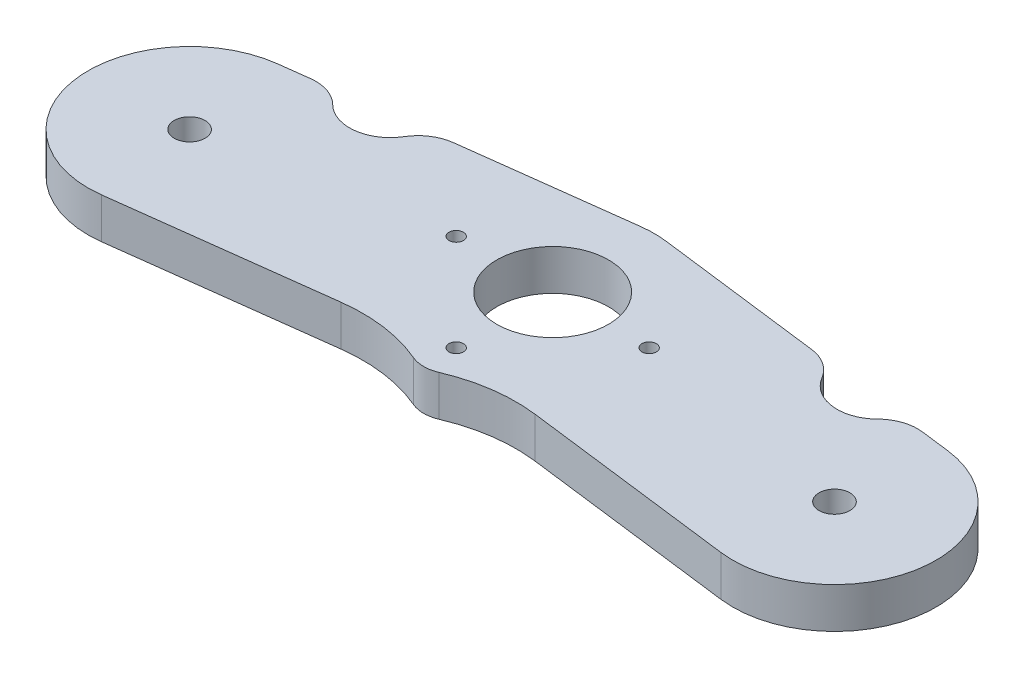
ISO-10303-21;
HEADER;
FILE_DESCRIPTION(('STEP AP214'),'2;1');
FILE_NAME('part.step','',(''),(''),'','','');
FILE_SCHEMA(('AUTOMOTIVE_DESIGN { 1 0 10303 214 1 1 1 1 }'));
ENDSEC;
DATA;
#1=APPLICATION_CONTEXT('core data for automotive mechanical design processes');
#2=APPLICATION_PROTOCOL_DEFINITION('international standard','automotive_design',2000,#1);
#3=PRODUCT_CONTEXT('',#1,'mechanical');
#4=PRODUCT('Part','Part','',(#3));
#5=PRODUCT_RELATED_PRODUCT_CATEGORY('part','',(#4));
#6=PRODUCT_DEFINITION_FORMATION('','',#4);
#7=PRODUCT_DEFINITION_CONTEXT('part definition',#1,'design');
#8=PRODUCT_DEFINITION('design','',#6,#7);
#9=PRODUCT_DEFINITION_SHAPE('','',#8);
#10=(LENGTH_UNIT() NAMED_UNIT(*) SI_UNIT(.MILLI.,.METRE.));
#11=(NAMED_UNIT(*) PLANE_ANGLE_UNIT() SI_UNIT($,.RADIAN.));
#12=(NAMED_UNIT(*) SI_UNIT($,.STERADIAN.) SOLID_ANGLE_UNIT());
#13=UNCERTAINTY_MEASURE_WITH_UNIT(LENGTH_MEASURE(1.E-05),#10,'distance_accuracy_value','');
#14=(GEOMETRIC_REPRESENTATION_CONTEXT(3) GLOBAL_UNCERTAINTY_ASSIGNED_CONTEXT((#13)) GLOBAL_UNIT_ASSIGNED_CONTEXT((#10,
#11,#12)) REPRESENTATION_CONTEXT('',''));
#15=CARTESIAN_POINT('',(0.,0.,0.));
#16=DIRECTION('',(0.,0.,1.));
#17=DIRECTION('',(1.,0.,0.));
#18=AXIS2_PLACEMENT_3D('',#15,#16,#17);
#19=CARTESIAN_POINT('',(1.984375,6.35,-15.7504882736814));
#20=DIRECTION('',(0.125,0.,-0.992156741649221));
#21=DIRECTION('',(-0.992156741649222,0.,-0.125));
#22=AXIS2_PLACEMENT_3D('',#19,#20,#21);
#23=PLANE('',#22);
#24=DIRECTION('',(0.992156741649222,0.,0.125));
#25=VECTOR('',#24,1.);
#26=CARTESIAN_POINT('',(1.984375,6.35,-15.7504882736814));
#27=LINE('',#26,#25);
#28=CARTESIAN_POINT('',(1.984375,6.35,-15.7504882736814));
#29=VERTEX_POINT('',#28);
#30=CARTESIAN_POINT('',(27.9995193503471,6.35,-12.4728881654687));
#31=VERTEX_POINT('',#30);
#32=EDGE_CURVE('E194',#29,#31,#27,.T.);
#33=ORIENTED_EDGE('',*,*,#32,.T.);
#34=DIRECTION('',(0.,-1.,0.));
#35=VECTOR('',#34,1.);
#36=CARTESIAN_POINT('',(27.9995193503471,0.,-12.4728881654687));
#37=LINE('',#36,#35);
#38=CARTESIAN_POINT('',(27.9995193503471,0.,-12.4728881654687));
#39=VERTEX_POINT('',#38);
#40=EDGE_CURVE('E286',#31,#39,#37,.T.);
#41=ORIENTED_EDGE('',*,*,#40,.T.);
#42=DIRECTION('',(0.992156741649222,0.,0.125));
#43=VECTOR('',#42,1.);
#44=CARTESIAN_POINT('',(1.984375,0.,-15.7504882736814));
#45=LINE('',#44,#43);
#46=CARTESIAN_POINT('',(1.984375,0.,-15.7504882736814));
#47=VERTEX_POINT('',#46);
#48=EDGE_CURVE('E218',#47,#39,#45,.T.);
#49=ORIENTED_EDGE('',*,*,#48,.F.);
#50=DIRECTION('',(0.,-1.,0.));
#51=VECTOR('',#50,1.);
#52=CARTESIAN_POINT('',(1.984375,6.35,-15.7504882736814));
#53=LINE('',#52,#51);
#54=EDGE_CURVE('E240',#29,#47,#53,.T.);
#55=ORIENTED_EDGE('',*,*,#54,.F.);
#56=EDGE_LOOP('',(#33,#41,#49,#55));
#57=FACE_BOUND('',#56,.T.);
#58=ADVANCED_FACE('F37',(#57),#23,.T.);
#59=CARTESIAN_POINT('',(-1.984375,6.35,-15.7504882736814));
#60=DIRECTION('',(0.125,0.,0.992156741649221));
#61=DIRECTION('',(0.992156741649221,0.,-0.125));
#62=AXIS2_PLACEMENT_3D('',#59,#60,#61);
#63=PLANE('',#62);
#64=DIRECTION('',(-0.992156741649221,0.,0.125));
#65=VECTOR('',#64,1.);
#66=CARTESIAN_POINT('',(-1.984375,0.,-15.7504882736814));
#67=LINE('',#66,#65);
#68=CARTESIAN_POINT('',(-1.984375,0.,-15.7504882736814));
#69=VERTEX_POINT('',#68);
#70=CARTESIAN_POINT('',(-27.9995193503471,0.,-12.4728881654687));
#71=VERTEX_POINT('',#70);
#72=EDGE_CURVE('E224',#69,#71,#67,.T.);
#73=ORIENTED_EDGE('',*,*,#72,.T.);
#74=DIRECTION('',(0.,1.,0.));
#75=VECTOR('',#74,1.);
#76=CARTESIAN_POINT('',(-27.9995193503471,6.35,-12.4728881654687));
#77=LINE('',#76,#75);
#78=CARTESIAN_POINT('',(-27.9995193503471,6.35,-12.4728881654687));
#79=VERTEX_POINT('',#78);
#80=EDGE_CURVE('E288',#71,#79,#77,.T.);
#81=ORIENTED_EDGE('',*,*,#80,.T.);
#82=DIRECTION('',(-0.992156741649221,0.,0.125));
#83=VECTOR('',#82,1.);
#84=CARTESIAN_POINT('',(-1.984375,6.35,-15.7504882736814));
#85=LINE('',#84,#83);
#86=CARTESIAN_POINT('',(-1.984375,6.35,-15.7504882736814));
#87=VERTEX_POINT('',#86);
#88=EDGE_CURVE('E201',#87,#79,#85,.T.);
#89=ORIENTED_EDGE('',*,*,#88,.F.);
#90=DIRECTION('',(0.,-1.,0.));
#91=VECTOR('',#90,1.);
#92=CARTESIAN_POINT('',(-1.984375,6.35,-15.7504882736814));
#93=LINE('',#92,#91);
#94=EDGE_CURVE('E237',#87,#69,#93,.T.);
#95=ORIENTED_EDGE('',*,*,#94,.T.);
#96=EDGE_LOOP('',(#73,#81,#89,#95));
#97=FACE_BOUND('',#96,.T.);
#98=ADVANCED_FACE('F306',(#97),#63,.F.);
#99=CARTESIAN_POINT('',(0.,6.35,15.08125));
#100=DIRECTION('',(0.,-1.,0.));
#101=DIRECTION('',(0.,0.,-1.));
#102=AXIS2_PLACEMENT_3D('',#99,#100,#101);
#103=CYLINDRICAL_SURFACE('',#102,5.08);
#104=CARTESIAN_POINT('',(0.,6.35,15.08125));
#105=DIRECTION('',(0.,1.,0.));
#106=DIRECTION('',(0.,0.,1.));
#107=AXIS2_PLACEMENT_3D('',#104,#105,#106);
#108=CIRCLE('',#107,5.08);
#109=CARTESIAN_POINT('',(-1.9959358107827,6.35,19.7527208860524));
#110=VERTEX_POINT('',#109);
#111=CARTESIAN_POINT('',(1.9959358107827,6.35,19.7527208860524));
#112=VERTEX_POINT('',#111);
#113=EDGE_CURVE('E177',#110,#112,#108,.T.);
#114=ORIENTED_EDGE('',*,*,#113,.F.);
#115=DIRECTION('',(0.,-1.,0.));
#116=VECTOR('',#115,1.);
#117=CARTESIAN_POINT('',(-1.9959358107827,6.35,19.7527208860524));
#118=LINE('',#117,#116);
#119=CARTESIAN_POINT('',(-1.9959358107827,0.,19.7527208860524));
#120=VERTEX_POINT('',#119);
#121=EDGE_CURVE('E250',#110,#120,#118,.T.);
#122=ORIENTED_EDGE('',*,*,#121,.T.);
#123=CARTESIAN_POINT('',(0.,0.,15.08125));
#124=DIRECTION('',(0.,1.,0.));
#125=DIRECTION('',(0.,0.,1.));
#126=AXIS2_PLACEMENT_3D('',#123,#124,#125);
#127=CIRCLE('',#126,5.08);
#128=CARTESIAN_POINT('',(1.9959358107827,0.,19.7527208860524));
#129=VERTEX_POINT('',#128);
#130=EDGE_CURVE('E210',#120,#129,#127,.T.);
#131=ORIENTED_EDGE('',*,*,#130,.T.);
#132=DIRECTION('',(0.,-1.,0.));
#133=VECTOR('',#132,1.);
#134=CARTESIAN_POINT('',(1.9959358107827,6.35,19.7527208860524));
#135=LINE('',#134,#133);
#136=EDGE_CURVE('E248',#129,#112,#135,.F.);
#137=ORIENTED_EDGE('',*,*,#136,.T.);
#138=EDGE_LOOP('',(#114,#122,#131,#137));
#139=FACE_BOUND('',#138,.T.);
#140=ADVANCED_FACE('F337',(#139),#103,.T.);
#141=CARTESIAN_POINT('',(-1.984375,6.35,15.7504882736814));
#142=DIRECTION('',(0.125,0.,-0.992156741649221));
#143=DIRECTION('',(-0.992156741649222,0.,-0.125));
#144=AXIS2_PLACEMENT_3D('',#141,#142,#143);
#145=PLANE('',#144);
#146=DIRECTION('',(0.992156741649222,0.,0.125));
#147=VECTOR('',#146,1.);
#148=CARTESIAN_POINT('',(-1.984375,6.35,15.7504882736814));
#149=LINE('',#148,#147);
#150=CARTESIAN_POINT('',(15.1506148646962,6.35,17.9092940784242));
#151=VERTEX_POINT('',#150);
#152=CARTESIAN_POINT('',(48.4171874757804,6.35,22.1004882736814));
#153=VERTEX_POINT('',#152);
#154=EDGE_CURVE('E163',#151,#153,#149,.T.);
#155=ORIENTED_EDGE('',*,*,#154,.F.);
#156=DIRECTION('',(0.,1.,0.));
#157=VECTOR('',#156,1.);
#158=CARTESIAN_POINT('',(15.1506148646962,0.,17.9092940784242));
#159=LINE('',#158,#157);
#160=CARTESIAN_POINT('',(15.1506148646962,0.,17.9092940784242));
#161=VERTEX_POINT('',#160);
#162=EDGE_CURVE('E255',#151,#161,#159,.F.);
#163=ORIENTED_EDGE('',*,*,#162,.T.);
#164=DIRECTION('',(0.992156741649222,0.,0.125));
#165=VECTOR('',#164,1.);
#166=CARTESIAN_POINT('',(-1.984375,0.,15.7504882736814));
#167=LINE('',#166,#165);
#168=CARTESIAN_POINT('',(48.4171874757804,0.,22.1004882736814));
#169=VERTEX_POINT('',#168);
#170=EDGE_CURVE('E183',#161,#169,#167,.T.);
#171=ORIENTED_EDGE('',*,*,#170,.T.);
#172=DIRECTION('',(0.,-1.,0.));
#173=VECTOR('',#172,1.);
#174=CARTESIAN_POINT('',(48.4171874757804,6.35,22.1004882736814));
#175=LINE('',#174,#173);
#176=EDGE_CURVE('E180',#153,#169,#175,.T.);
#177=ORIENTED_EDGE('',*,*,#176,.F.);
#178=EDGE_LOOP('',(#155,#163,#171,#177));
#179=FACE_BOUND('',#178,.T.);
#180=ADVANCED_FACE('F181',(#179),#145,.F.);
#181=CARTESIAN_POINT('',(50.4015624757804,6.35,6.35000000000001));
#182=DIRECTION('',(0.,-1.,0.));
#183=DIRECTION('',(0.,0.,-1.));
#184=AXIS2_PLACEMENT_3D('',#181,#182,#183);
#185=CYLINDRICAL_SURFACE('',#184,15.875);
#186=CARTESIAN_POINT('',(50.4015624757804,0.,6.35000000000001));
#187=DIRECTION('',(0.,1.,0.));
#188=DIRECTION('',(0.,0.,1.));
#189=AXIS2_PLACEMENT_3D('',#186,#187,#188);
#190=CIRCLE('',#189,15.875);
#191=CARTESIAN_POINT('',(52.3859374757805,0.,-9.40048827368138));
#192=VERTEX_POINT('',#191);
#193=EDGE_CURVE('E215',#169,#192,#190,.T.);
#194=ORIENTED_EDGE('',*,*,#193,.T.);
#195=DIRECTION('',(0.,-1.,0.));
#196=VECTOR('',#195,1.);
#197=CARTESIAN_POINT('',(52.3859374757805,6.35,-9.40048827368138));
#198=LINE('',#197,#196);
#199=CARTESIAN_POINT('',(52.3859374757805,6.35,-9.40048827368138));
#200=VERTEX_POINT('',#199);
#201=EDGE_CURVE('E188',#200,#192,#198,.T.);
#202=ORIENTED_EDGE('',*,*,#201,.F.);
#203=CARTESIAN_POINT('',(50.4015624757804,6.35,6.35000000000001));
#204=DIRECTION('',(0.,1.,0.));
#205=DIRECTION('',(0.,0.,1.));
#206=AXIS2_PLACEMENT_3D('',#203,#204,#205);
#207=CIRCLE('',#206,15.875);
#208=EDGE_CURVE('E169',#153,#200,#207,.T.);
#209=ORIENTED_EDGE('',*,*,#208,.F.);
#210=ORIENTED_EDGE('',*,*,#176,.T.);
#211=EDGE_LOOP('',(#194,#202,#209,#210));
#212=FACE_BOUND('',#211,.T.);
#213=ADVANCED_FACE('F190',(#212),#185,.T.);
#214=CARTESIAN_POINT('',(47.8285079949167,0.,-9.97467041768518));
#215=VERTEX_POINT('',#214);
#216=EDGE_CURVE('E217',#215,#192,#45,.T.);
#217=ORIENTED_EDGE('',*,*,#216,.F.);
#218=DIRECTION('',(0.,-1.,0.));
#219=VECTOR('',#218,1.);
#220=CARTESIAN_POINT('',(47.8285079949166,6.35,-9.97467041768518));
#221=LINE('',#220,#219);
#222=CARTESIAN_POINT('',(47.8285079949167,6.35,-9.97467041768518));
#223=VERTEX_POINT('',#222);
#224=EDGE_CURVE('E278',#215,#223,#221,.F.);
#225=ORIENTED_EDGE('',*,*,#224,.T.);
#226=EDGE_CURVE('E192',#223,#200,#27,.T.);
#227=ORIENTED_EDGE('',*,*,#226,.T.);
#228=ORIENTED_EDGE('',*,*,#201,.T.);
#229=EDGE_LOOP('',(#217,#225,#227,#228));
#230=FACE_BOUND('',#229,.T.);
#231=ADVANCED_FACE('F331',(#230),#23,.T.);
#232=CARTESIAN_POINT('',(0.,6.35,0.));
#233=DIRECTION('',(0.,-1.,0.));
#234=DIRECTION('',(0.,0.,-1.));
#235=AXIS2_PLACEMENT_3D('',#232,#233,#234);
#236=CYLINDRICAL_SURFACE('',#235,15.875);
#237=CARTESIAN_POINT('',(0.,0.,0.));
#238=DIRECTION('',(0.,1.,0.));
#239=DIRECTION('',(0.,0.,1.));
#240=AXIS2_PLACEMENT_3D('',#237,#238,#239);
#241=CIRCLE('',#240,15.875);
#242=EDGE_CURVE('E221',#47,#69,#241,.T.);
#243=ORIENTED_EDGE('',*,*,#242,.T.);
#244=ORIENTED_EDGE('',*,*,#94,.F.);
#245=CARTESIAN_POINT('',(0.,6.35,0.));
#246=DIRECTION('',(0.,1.,0.));
#247=DIRECTION('',(0.,0.,1.));
#248=AXIS2_PLACEMENT_3D('',#245,#246,#247);
#249=CIRCLE('',#248,15.875);
#250=EDGE_CURVE('E198',#29,#87,#249,.T.);
#251=ORIENTED_EDGE('',*,*,#250,.F.);
#252=ORIENTED_EDGE('',*,*,#54,.T.);
#253=EDGE_LOOP('',(#243,#244,#251,#252));
#254=FACE_BOUND('',#253,.T.);
#255=ADVANCED_FACE('F310',(#254),#236,.T.);
#256=CARTESIAN_POINT('',(-47.8285079949166,6.35,-9.97467041768518));
#257=VERTEX_POINT('',#256);
#258=CARTESIAN_POINT('',(-52.3859374757805,6.35,-9.40048827368137));
#259=VERTEX_POINT('',#258);
#260=EDGE_CURVE('E200',#257,#259,#85,.T.);
#261=ORIENTED_EDGE('',*,*,#260,.F.);
#262=DIRECTION('',(0.,1.,0.));
#263=VECTOR('',#262,1.);
#264=CARTESIAN_POINT('',(-47.8285079949166,6.35,-9.97467041768518));
#265=LINE('',#264,#263);
#266=CARTESIAN_POINT('',(-47.8285079949166,0.,-9.97467041768518));
#267=VERTEX_POINT('',#266);
#268=EDGE_CURVE('E11',#257,#267,#265,.F.);
#269=ORIENTED_EDGE('',*,*,#268,.T.);
#270=CARTESIAN_POINT('',(-52.3859374757805,0.,-9.40048827368137));
#271=VERTEX_POINT('',#270);
#272=EDGE_CURVE('E223',#267,#271,#67,.T.);
#273=ORIENTED_EDGE('',*,*,#272,.T.);
#274=DIRECTION('',(0.,-1.,0.));
#275=VECTOR('',#274,1.);
#276=CARTESIAN_POINT('',(-52.3859374757805,6.35,-9.40048827368137));
#277=LINE('',#276,#275);
#278=EDGE_CURVE('E234',#259,#271,#277,.T.);
#279=ORIENTED_EDGE('',*,*,#278,.F.);
#280=EDGE_LOOP('',(#261,#269,#273,#279));
#281=FACE_BOUND('',#280,.T.);
#282=ADVANCED_FACE('F356',(#281),#63,.F.);
#283=CARTESIAN_POINT('',(-50.4015624757804,6.35,6.35000000000001));
#284=DIRECTION('',(0.,-1.,0.));
#285=DIRECTION('',(0.,0.,-1.));
#286=AXIS2_PLACEMENT_3D('',#283,#284,#285);
#287=CYLINDRICAL_SURFACE('',#286,15.875);
#288=CARTESIAN_POINT('',(-50.4015624757804,0.,6.35000000000001));
#289=DIRECTION('',(0.,1.,0.));
#290=DIRECTION('',(0.,0.,1.));
#291=AXIS2_PLACEMENT_3D('',#288,#289,#290);
#292=CIRCLE('',#291,15.875);
#293=CARTESIAN_POINT('',(-48.4171874757804,0.,22.1004882736814));
#294=VERTEX_POINT('',#293);
#295=EDGE_CURVE('E227',#271,#294,#292,.T.);
#296=ORIENTED_EDGE('',*,*,#295,.T.);
#297=DIRECTION('',(0.,-1.,0.));
#298=VECTOR('',#297,1.);
#299=CARTESIAN_POINT('',(-48.4171874757804,6.35,22.1004882736814));
#300=LINE('',#299,#298);
#301=CARTESIAN_POINT('',(-48.4171874757804,6.35,22.1004882736814));
#302=VERTEX_POINT('',#301);
#303=EDGE_CURVE('E209',#302,#294,#300,.T.);
#304=ORIENTED_EDGE('',*,*,#303,.F.);
#305=CARTESIAN_POINT('',(-50.4015624757804,6.35,6.35000000000001));
#306=DIRECTION('',(0.,1.,0.));
#307=DIRECTION('',(0.,0.,1.));
#308=AXIS2_PLACEMENT_3D('',#305,#306,#307);
#309=CIRCLE('',#308,15.875);
#310=EDGE_CURVE('E204',#259,#302,#309,.T.);
#311=ORIENTED_EDGE('',*,*,#310,.F.);
#312=ORIENTED_EDGE('',*,*,#278,.T.);
#313=EDGE_LOOP('',(#296,#304,#311,#312));
#314=FACE_BOUND('',#313,.T.);
#315=ADVANCED_FACE('F390',(#314),#287,.T.);
#316=CARTESIAN_POINT('',(1.984375,6.35,15.7504882736814));
#317=DIRECTION('',(0.125,0.,0.992156741649221));
#318=DIRECTION('',(0.992156741649222,0.,-0.125));
#319=AXIS2_PLACEMENT_3D('',#316,#317,#318);
#320=PLANE('',#319);
#321=DIRECTION('',(-0.992156741649222,0.,0.125));
#322=VECTOR('',#321,1.);
#323=CARTESIAN_POINT('',(1.984375,0.,15.7504882736814));
#324=LINE('',#323,#322);
#325=CARTESIAN_POINT('',(-15.1506148646962,0.,17.9092940784242));
#326=VERTEX_POINT('',#325);
#327=EDGE_CURVE('E230',#326,#294,#324,.T.);
#328=ORIENTED_EDGE('',*,*,#327,.F.);
#329=DIRECTION('',(0.,-1.,0.));
#330=VECTOR('',#329,1.);
#331=CARTESIAN_POINT('',(-15.1506148646962,6.35,17.9092940784242));
#332=LINE('',#331,#330);
#333=CARTESIAN_POINT('',(-15.1506148646962,6.35,17.9092940784242));
#334=VERTEX_POINT('',#333);
#335=EDGE_CURVE('E253',#326,#334,#332,.F.);
#336=ORIENTED_EDGE('',*,*,#335,.T.);
#337=DIRECTION('',(-0.992156741649222,0.,0.125));
#338=VECTOR('',#337,1.);
#339=CARTESIAN_POINT('',(1.984375,6.35,15.7504882736814));
#340=LINE('',#339,#338);
#341=EDGE_CURVE('E207',#334,#302,#340,.T.);
#342=ORIENTED_EDGE('',*,*,#341,.T.);
#343=ORIENTED_EDGE('',*,*,#303,.T.);
#344=EDGE_LOOP('',(#328,#336,#342,#343));
#345=FACE_BOUND('',#344,.T.);
#346=ADVANCED_FACE('F385',(#345),#320,.T.);
#347=CARTESIAN_POINT('',(0.,6.35,0.));
#348=DIRECTION('',(0.,1.,0.));
#349=DIRECTION('',(0.,0.,1.));
#350=AXIS2_PLACEMENT_3D('',#347,#348,#349);
#351=PLANE('',#350);
#352=CARTESIAN_POINT('',(-15.08125,6.35,0.));
#353=DIRECTION('',(0.,1.,0.));
#354=DIRECTION('',(0.,0.,1.));
#355=AXIS2_PLACEMENT_3D('',#352,#353,#354);
#356=CIRCLE('',#355,1.13029999999999);
#357=CARTESIAN_POINT('',(-15.08125,6.35,1.13029999999999));
#358=VERTEX_POINT('',#357);
#359=EDGE_CURVE('E638',#358,#358,#356,.T.);
#360=ORIENTED_EDGE('',*,*,#359,.F.);
#361=EDGE_LOOP('',(#360));
#362=FACE_BOUND('',#361,.T.);
#363=CARTESIAN_POINT('',(15.08125,6.35,0.));
#364=DIRECTION('',(0.,1.,0.));
#365=DIRECTION('',(0.,0.,1.));
#366=AXIS2_PLACEMENT_3D('',#363,#364,#365);
#367=CIRCLE('',#366,1.13029999999999);
#368=CARTESIAN_POINT('',(15.08125,6.35,1.13029999999999));
#369=VERTEX_POINT('',#368);
#370=EDGE_CURVE('E632',#369,#369,#367,.T.);
#371=ORIENTED_EDGE('',*,*,#370,.F.);
#372=EDGE_LOOP('',(#371));
#373=FACE_BOUND('',#372,.T.);
#374=CARTESIAN_POINT('',(0.,6.35,15.08125));
#375=DIRECTION('',(0.,1.,0.));
#376=DIRECTION('',(0.,0.,1.));
#377=AXIS2_PLACEMENT_3D('',#374,#375,#376);
#378=CIRCLE('',#377,1.13029999999999);
#379=CARTESIAN_POINT('',(0.,6.35,16.21155));
#380=VERTEX_POINT('',#379);
#381=EDGE_CURVE('E626',#380,#380,#378,.T.);
#382=ORIENTED_EDGE('',*,*,#381,.F.);
#383=EDGE_LOOP('',(#382));
#384=FACE_BOUND('',#383,.T.);
#385=ORIENTED_EDGE('',*,*,#226,.F.);
#386=CARTESIAN_POINT('',(47.0347579949166,6.35,-3.67447510821263));
#387=DIRECTION('',(0.,1.,0.));
#388=DIRECTION('',(0.,0.,1.));
#389=AXIS2_PLACEMENT_3D('',#386,#387,#388);
#390=CIRCLE('',#389,6.35);
#391=CARTESIAN_POINT('',(42.5673789974583,6.35,-8.18723755410631));
#392=VERTEX_POINT('',#391);
#393=EDGE_CURVE('E284',#223,#392,#390,.T.);
#394=ORIENTED_EDGE('',*,*,#393,.T.);
#395=CARTESIAN_POINT('',(38.1,6.35,-12.7));
#396=DIRECTION('',(0.,1.,0.));
#397=DIRECTION('',(0.,0.,1.));
#398=AXIS2_PLACEMENT_3D('',#395,#396,#397);
#399=CIRCLE('',#398,6.35);
#400=CARTESIAN_POINT('',(32.6528846751735,6.35,-9.43634642799809));
#401=VERTEX_POINT('',#400);
#402=EDGE_CURVE('E324',#401,#392,#399,.T.);
#403=ORIENTED_EDGE('',*,*,#402,.F.);
#404=CARTESIAN_POINT('',(27.2057693503471,6.35,-6.17269285599619));
#405=DIRECTION('',(0.,1.,0.));
#406=DIRECTION('',(0.,0.,1.));
#407=AXIS2_PLACEMENT_3D('',#404,#405,#406);
#408=CIRCLE('',#407,6.35);
#409=EDGE_CURVE('E60',#401,#31,#408,.T.);
#410=ORIENTED_EDGE('',*,*,#409,.T.);
#411=ORIENTED_EDGE('',*,*,#32,.F.);
#412=ORIENTED_EDGE('',*,*,#250,.T.);
#413=ORIENTED_EDGE('',*,*,#88,.T.);
#414=CARTESIAN_POINT('',(-27.2057693503471,6.35,-6.17269285599618));
#415=DIRECTION('',(0.,1.,0.));
#416=DIRECTION('',(0.,0.,1.));
#417=AXIS2_PLACEMENT_3D('',#414,#415,#416);
#418=CIRCLE('',#417,6.35);
#419=CARTESIAN_POINT('',(-32.6528846751735,6.35,-9.43634642799809));
#420=VERTEX_POINT('',#419);
#421=EDGE_CURVE('E52',#79,#420,#418,.T.);
#422=ORIENTED_EDGE('',*,*,#421,.T.);
#423=CARTESIAN_POINT('',(-38.1,6.35,-12.7));
#424=DIRECTION('',(0.,1.,0.));
#425=DIRECTION('',(0.,0.,1.));
#426=AXIS2_PLACEMENT_3D('',#423,#424,#425);
#427=CIRCLE('',#426,6.35);
#428=CARTESIAN_POINT('',(-42.5673789974583,6.35,-8.18723755410631));
#429=VERTEX_POINT('',#428);
#430=EDGE_CURVE('E297',#429,#420,#427,.T.);
#431=ORIENTED_EDGE('',*,*,#430,.F.);
#432=CARTESIAN_POINT('',(-47.0347579949166,6.35,-3.67447510821262));
#433=DIRECTION('',(0.,1.,0.));
#434=DIRECTION('',(0.,0.,1.));
#435=AXIS2_PLACEMENT_3D('',#432,#433,#434);
#436=CIRCLE('',#435,6.35);
#437=EDGE_CURVE('E280',#429,#257,#436,.T.);
#438=ORIENTED_EDGE('',*,*,#437,.T.);
#439=ORIENTED_EDGE('',*,*,#260,.T.);
#440=ORIENTED_EDGE('',*,*,#310,.T.);
#441=ORIENTED_EDGE('',*,*,#341,.F.);
#442=CARTESIAN_POINT('',(-11.9756148646962,6.35,43.1100753163144));
#443=DIRECTION('',(0.,1.,0.));
#444=DIRECTION('',(0.,0.,1.));
#445=AXIS2_PLACEMENT_3D('',#442,#443,#444);
#446=CIRCLE('',#445,25.4);
#447=EDGE_CURVE('E259',#334,#110,#446,.F.);
#448=ORIENTED_EDGE('',*,*,#447,.T.);
#449=ORIENTED_EDGE('',*,*,#113,.T.);
#450=CARTESIAN_POINT('',(11.9756148646962,6.35,43.1100753163144));
#451=DIRECTION('',(0.,1.,0.));
#452=DIRECTION('',(0.,0.,1.));
#453=AXIS2_PLACEMENT_3D('',#450,#451,#452);
#454=CIRCLE('',#453,25.4);
#455=EDGE_CURVE('E173',#112,#151,#454,.F.);
#456=ORIENTED_EDGE('',*,*,#455,.T.);
#457=ORIENTED_EDGE('',*,*,#154,.T.);
#458=ORIENTED_EDGE('',*,*,#208,.T.);
#459=EDGE_LOOP('',(#385,#394,#403,#410,#411,#412,#413,#422,#431,#438,#439,#440,#441,#448,#449,
#456,#457,#458));
#460=FACE_BOUND('',#459,.T.);
#461=CARTESIAN_POINT('',(0.,6.35,0.));
#462=DIRECTION('',(0.,1.,0.));
#463=DIRECTION('',(0.,0.,1.));
#464=AXIS2_PLACEMENT_3D('',#461,#462,#463);
#465=CIRCLE('',#464,8.73125);
#466=CARTESIAN_POINT('',(0.,6.35,8.73125));
#467=VERTEX_POINT('',#466);
#468=EDGE_CURVE('E592',#467,#467,#465,.T.);
#469=ORIENTED_EDGE('',*,*,#468,.F.);
#470=EDGE_LOOP('',(#469));
#471=FACE_BOUND('',#470,.T.);
#472=CARTESIAN_POINT('',(-50.4015624757804,6.35,6.35000000000001));
#473=DIRECTION('',(0.,1.,0.));
#474=DIRECTION('',(0.,0.,1.));
#475=AXIS2_PLACEMENT_3D('',#472,#473,#474);
#476=CIRCLE('',#475,2.41299999999999);
#477=CARTESIAN_POINT('',(-50.4015624757804,6.35,8.763));
#478=VERTEX_POINT('',#477);
#479=EDGE_CURVE('E603',#478,#478,#476,.T.);
#480=ORIENTED_EDGE('',*,*,#479,.F.);
#481=EDGE_LOOP('',(#480));
#482=FACE_BOUND('',#481,.T.);
#483=CARTESIAN_POINT('',(50.4015624757804,6.35,6.35000000000001));
#484=DIRECTION('',(0.,1.,0.));
#485=DIRECTION('',(0.,0.,1.));
#486=AXIS2_PLACEMENT_3D('',#483,#484,#485);
#487=CIRCLE('',#486,2.41299999999999);
#488=CARTESIAN_POINT('',(50.4015624757804,6.35,8.763));
#489=VERTEX_POINT('',#488);
#490=EDGE_CURVE('E610',#489,#489,#487,.T.);
#491=ORIENTED_EDGE('',*,*,#490,.F.);
#492=EDGE_LOOP('',(#491));
#493=FACE_BOUND('',#492,.T.);
#494=ADVANCED_FACE('F166',(#362,#373,#384,#460,#471,#482,#493),#351,.T.);
#495=CARTESIAN_POINT('',(0.,0.,0.));
#496=DIRECTION('',(0.,1.,0.));
#497=DIRECTION('',(0.,0.,1.));
#498=AXIS2_PLACEMENT_3D('',#495,#496,#497);
#499=PLANE('',#498);
#500=CARTESIAN_POINT('',(-15.08125,0.,0.));
#501=DIRECTION('',(0.,1.,0.));
#502=DIRECTION('',(0.,0.,1.));
#503=AXIS2_PLACEMENT_3D('',#500,#501,#502);
#504=CIRCLE('',#503,1.1303);
#505=CARTESIAN_POINT('',(-15.08125,0.,1.1303));
#506=VERTEX_POINT('',#505);
#507=EDGE_CURVE('E635',#506,#506,#504,.T.);
#508=ORIENTED_EDGE('',*,*,#507,.T.);
#509=EDGE_LOOP('',(#508));
#510=FACE_BOUND('',#509,.T.);
#511=CARTESIAN_POINT('',(15.08125,0.,0.));
#512=DIRECTION('',(0.,1.,0.));
#513=DIRECTION('',(0.,0.,1.));
#514=AXIS2_PLACEMENT_3D('',#511,#512,#513);
#515=CIRCLE('',#514,1.1303);
#516=CARTESIAN_POINT('',(15.08125,0.,1.1303));
#517=VERTEX_POINT('',#516);
#518=EDGE_CURVE('E629',#517,#517,#515,.T.);
#519=ORIENTED_EDGE('',*,*,#518,.T.);
#520=EDGE_LOOP('',(#519));
#521=FACE_BOUND('',#520,.T.);
#522=CARTESIAN_POINT('',(0.,0.,15.08125));
#523=DIRECTION('',(0.,1.,0.));
#524=DIRECTION('',(0.,0.,1.));
#525=AXIS2_PLACEMENT_3D('',#522,#523,#524);
#526=CIRCLE('',#525,1.1303);
#527=CARTESIAN_POINT('',(0.,0.,16.21155));
#528=VERTEX_POINT('',#527);
#529=EDGE_CURVE('E597',#528,#528,#526,.T.);
#530=ORIENTED_EDGE('',*,*,#529,.T.);
#531=EDGE_LOOP('',(#530));
#532=FACE_BOUND('',#531,.T.);
#533=CARTESIAN_POINT('',(0.,0.,0.));
#534=DIRECTION('',(0.,1.,0.));
#535=DIRECTION('',(0.,0.,1.));
#536=AXIS2_PLACEMENT_3D('',#533,#534,#535);
#537=CIRCLE('',#536,8.73125);
#538=CARTESIAN_POINT('',(0.,0.,8.73125));
#539=VERTEX_POINT('',#538);
#540=EDGE_CURVE('E595',#539,#539,#537,.T.);
#541=ORIENTED_EDGE('',*,*,#540,.T.);
#542=EDGE_LOOP('',(#541));
#543=FACE_BOUND('',#542,.T.);
#544=CARTESIAN_POINT('',(-50.4015624757804,0.,6.35000000000001));
#545=DIRECTION('',(0.,1.,0.));
#546=DIRECTION('',(0.,0.,1.));
#547=AXIS2_PLACEMENT_3D('',#544,#545,#546);
#548=CIRCLE('',#547,2.413);
#549=CARTESIAN_POINT('',(-50.4015624757804,0.,8.76300000000001));
#550=VERTEX_POINT('',#549);
#551=EDGE_CURVE('E607',#550,#550,#548,.T.);
#552=ORIENTED_EDGE('',*,*,#551,.T.);
#553=EDGE_LOOP('',(#552));
#554=FACE_BOUND('',#553,.T.);
#555=CARTESIAN_POINT('',(50.4015624757804,0.,6.35000000000001));
#556=DIRECTION('',(0.,1.,0.));
#557=DIRECTION('',(0.,0.,1.));
#558=AXIS2_PLACEMENT_3D('',#555,#556,#557);
#559=CIRCLE('',#558,2.413);
#560=CARTESIAN_POINT('',(50.4015624757804,0.,8.76300000000001));
#561=VERTEX_POINT('',#560);
#562=EDGE_CURVE('E213',#561,#561,#559,.T.);
#563=ORIENTED_EDGE('',*,*,#562,.T.);
#564=EDGE_LOOP('',(#563));
#565=FACE_BOUND('',#564,.T.);
#566=CARTESIAN_POINT('',(38.1,0.,-12.7));
#567=DIRECTION('',(0.,1.,0.));
#568=DIRECTION('',(0.,0.,1.));
#569=AXIS2_PLACEMENT_3D('',#566,#567,#568);
#570=CIRCLE('',#569,6.35);
#571=CARTESIAN_POINT('',(32.6528846751735,0.,-9.43634642799809));
#572=VERTEX_POINT('',#571);
#573=CARTESIAN_POINT('',(42.5673789974583,0.,-8.18723755410631));
#574=VERTEX_POINT('',#573);
#575=EDGE_CURVE('E187',#572,#574,#570,.T.);
#576=ORIENTED_EDGE('',*,*,#575,.T.);
#577=CARTESIAN_POINT('',(47.0347579949166,0.,-3.67447510821263));
#578=DIRECTION('',(0.,1.,0.));
#579=DIRECTION('',(0.,0.,1.));
#580=AXIS2_PLACEMENT_3D('',#577,#578,#579);
#581=CIRCLE('',#580,6.35);
#582=EDGE_CURVE('E276',#574,#215,#581,.F.);
#583=ORIENTED_EDGE('',*,*,#582,.T.);
#584=ORIENTED_EDGE('',*,*,#216,.T.);
#585=ORIENTED_EDGE('',*,*,#193,.F.);
#586=ORIENTED_EDGE('',*,*,#170,.F.);
#587=CARTESIAN_POINT('',(11.9756148646962,0.,43.1100753163144));
#588=DIRECTION('',(0.,1.,0.));
#589=DIRECTION('',(0.,0.,1.));
#590=AXIS2_PLACEMENT_3D('',#587,#588,#589);
#591=CIRCLE('',#590,25.4);
#592=EDGE_CURVE('E261',#161,#129,#591,.T.);
#593=ORIENTED_EDGE('',*,*,#592,.T.);
#594=ORIENTED_EDGE('',*,*,#130,.F.);
#595=CARTESIAN_POINT('',(-11.9756148646962,0.,43.1100753163144));
#596=DIRECTION('',(0.,1.,0.));
#597=DIRECTION('',(0.,0.,1.));
#598=AXIS2_PLACEMENT_3D('',#595,#596,#597);
#599=CIRCLE('',#598,25.4);
#600=EDGE_CURVE('E257',#120,#326,#599,.T.);
#601=ORIENTED_EDGE('',*,*,#600,.T.);
#602=ORIENTED_EDGE('',*,*,#327,.T.);
#603=ORIENTED_EDGE('',*,*,#295,.F.);
#604=ORIENTED_EDGE('',*,*,#272,.F.);
#605=CARTESIAN_POINT('',(-47.0347579949166,0.,-3.67447510821262));
#606=DIRECTION('',(0.,1.,0.));
#607=DIRECTION('',(0.,0.,1.));
#608=AXIS2_PLACEMENT_3D('',#605,#606,#607);
#609=CIRCLE('',#608,6.35);
#610=CARTESIAN_POINT('',(-42.5673789974583,0.,-8.18723755410631));
#611=VERTEX_POINT('',#610);
#612=EDGE_CURVE('E270',#267,#611,#609,.F.);
#613=ORIENTED_EDGE('',*,*,#612,.T.);
#614=CARTESIAN_POINT('',(-38.1,0.,-12.7));
#615=DIRECTION('',(0.,1.,0.));
#616=DIRECTION('',(0.,0.,1.));
#617=AXIS2_PLACEMENT_3D('',#614,#615,#616);
#618=CIRCLE('',#617,6.35);
#619=CARTESIAN_POINT('',(-32.6528846751735,0.,-9.43634642799809));
#620=VERTEX_POINT('',#619);
#621=EDGE_CURVE('E245',#611,#620,#618,.T.);
#622=ORIENTED_EDGE('',*,*,#621,.T.);
#623=CARTESIAN_POINT('',(-27.2057693503471,0.,-6.17269285599618));
#624=DIRECTION('',(0.,1.,0.));
#625=DIRECTION('',(0.,0.,1.));
#626=AXIS2_PLACEMENT_3D('',#623,#624,#625);
#627=CIRCLE('',#626,6.35);
#628=EDGE_CURVE('E272',#620,#71,#627,.F.);
#629=ORIENTED_EDGE('',*,*,#628,.T.);
#630=ORIENTED_EDGE('',*,*,#72,.F.);
#631=ORIENTED_EDGE('',*,*,#242,.F.);
#632=ORIENTED_EDGE('',*,*,#48,.T.);
#633=CARTESIAN_POINT('',(27.2057693503471,0.,-6.17269285599619));
#634=DIRECTION('',(0.,1.,0.));
#635=DIRECTION('',(0.,0.,1.));
#636=AXIS2_PLACEMENT_3D('',#633,#634,#635);
#637=CIRCLE('',#636,6.35);
#638=EDGE_CURVE('E274',#39,#572,#637,.F.);
#639=ORIENTED_EDGE('',*,*,#638,.T.);
#640=EDGE_LOOP('',(#576,#583,#584,#585,#586,#593,#594,#601,#602,#603,#604,#613,#622,#629,#630,
#631,#632,#639));
#641=FACE_BOUND('',#640,.T.);
#642=ADVANCED_FACE('F300',(#510,#521,#532,#543,#554,#565,#641),#499,.F.);
#643=CARTESIAN_POINT('',(50.4015624757804,6.35,6.35000000000001));
#644=DIRECTION('',(0.,1.,0.));
#645=DIRECTION('',(0.,0.,1.));
#646=AXIS2_PLACEMENT_3D('',#643,#644,#645);
#647=CYLINDRICAL_SURFACE('',#646,2.41299999999999);
#648=ORIENTED_EDGE('',*,*,#562,.F.);
#649=EDGE_LOOP('',(#648));
#650=FACE_BOUND('',#649,.T.);
#651=ORIENTED_EDGE('',*,*,#490,.T.);
#652=EDGE_LOOP('',(#651));
#653=FACE_BOUND('',#652,.T.);
#654=ADVANCED_FACE('F497',(#650,#653),#647,.F.);
#655=CARTESIAN_POINT('',(-50.4015624757804,6.35,6.35000000000001));
#656=DIRECTION('',(0.,1.,0.));
#657=DIRECTION('',(0.,0.,1.));
#658=AXIS2_PLACEMENT_3D('',#655,#656,#657);
#659=CYLINDRICAL_SURFACE('',#658,2.41299999999999);
#660=ORIENTED_EDGE('',*,*,#551,.F.);
#661=EDGE_LOOP('',(#660));
#662=FACE_BOUND('',#661,.T.);
#663=ORIENTED_EDGE('',*,*,#479,.T.);
#664=EDGE_LOOP('',(#663));
#665=FACE_BOUND('',#664,.T.);
#666=ADVANCED_FACE('F540',(#662,#665),#659,.F.);
#667=CARTESIAN_POINT('',(0.,0.,0.));
#668=DIRECTION('',(0.,1.,0.));
#669=DIRECTION('',(0.,0.,1.));
#670=AXIS2_PLACEMENT_3D('',#667,#668,#669);
#671=CYLINDRICAL_SURFACE('',#670,8.73125);
#672=ORIENTED_EDGE('',*,*,#540,.F.);
#673=EDGE_LOOP('',(#672));
#674=FACE_BOUND('',#673,.T.);
#675=ORIENTED_EDGE('',*,*,#468,.T.);
#676=EDGE_LOOP('',(#675));
#677=FACE_BOUND('',#676,.T.);
#678=ADVANCED_FACE('F440',(#674,#677),#671,.F.);
#679=CARTESIAN_POINT('',(38.1,0.,-12.7));
#680=DIRECTION('',(0.,1.,0.));
#681=DIRECTION('',(0.,0.,1.));
#682=AXIS2_PLACEMENT_3D('',#679,#680,#681);
#683=CYLINDRICAL_SURFACE('',#682,6.35);
#684=ORIENTED_EDGE('',*,*,#402,.T.);
#685=DIRECTION('',(0.,1.,0.));
#686=VECTOR('',#685,1.);
#687=CARTESIAN_POINT('',(42.5673789974583,0.,-8.18723755410631));
#688=LINE('',#687,#686);
#689=EDGE_CURVE('E267',#392,#574,#688,.F.);
#690=ORIENTED_EDGE('',*,*,#689,.T.);
#691=ORIENTED_EDGE('',*,*,#575,.F.);
#692=DIRECTION('',(0.,1.,0.));
#693=VECTOR('',#692,1.);
#694=CARTESIAN_POINT('',(32.6528846751735,0.,-9.43634642799809));
#695=LINE('',#694,#693);
#696=EDGE_CURVE('E264',#572,#401,#695,.T.);
#697=ORIENTED_EDGE('',*,*,#696,.T.);
#698=EDGE_LOOP('',(#684,#690,#691,#697));
#699=FACE_BOUND('',#698,.T.);
#700=ADVANCED_FACE('F322',(#699),#683,.F.);
#701=CARTESIAN_POINT('',(-38.1,0.,-12.7));
#702=DIRECTION('',(0.,1.,0.));
#703=DIRECTION('',(0.,0.,1.));
#704=AXIS2_PLACEMENT_3D('',#701,#702,#703);
#705=CYLINDRICAL_SURFACE('',#704,6.35);
#706=ORIENTED_EDGE('',*,*,#430,.T.);
#707=DIRECTION('',(0.,1.,0.));
#708=VECTOR('',#707,1.);
#709=CARTESIAN_POINT('',(-32.6528846751735,0.,-9.43634642799809));
#710=LINE('',#709,#708);
#711=EDGE_CURVE('E45',#420,#620,#710,.F.);
#712=ORIENTED_EDGE('',*,*,#711,.T.);
#713=ORIENTED_EDGE('',*,*,#621,.F.);
#714=DIRECTION('',(0.,1.,0.));
#715=VECTOR('',#714,1.);
#716=CARTESIAN_POINT('',(-42.5673789974583,0.,-8.18723755410631));
#717=LINE('',#716,#715);
#718=EDGE_CURVE('E290',#611,#429,#717,.T.);
#719=ORIENTED_EDGE('',*,*,#718,.T.);
#720=EDGE_LOOP('',(#706,#712,#713,#719));
#721=FACE_BOUND('',#720,.T.);
#722=ADVANCED_FACE('F294',(#721),#705,.F.);
#723=CARTESIAN_POINT('',(-11.9756148646962,6.35,43.1100753163144));
#724=DIRECTION('',(0.,-1.,0.));
#725=DIRECTION('',(0.,0.,-1.));
#726=AXIS2_PLACEMENT_3D('',#723,#724,#725);
#727=CYLINDRICAL_SURFACE('',#726,25.4);
#728=ORIENTED_EDGE('',*,*,#447,.F.);
#729=ORIENTED_EDGE('',*,*,#335,.F.);
#730=ORIENTED_EDGE('',*,*,#600,.F.);
#731=ORIENTED_EDGE('',*,*,#121,.F.);
#732=EDGE_LOOP('',(#728,#729,#730,#731));
#733=FACE_BOUND('',#732,.T.);
#734=ADVANCED_FACE('F341',(#733),#727,.F.);
#735=CARTESIAN_POINT('',(11.9756148646962,6.35,43.1100753163144));
#736=DIRECTION('',(0.,-1.,0.));
#737=DIRECTION('',(0.,0.,-1.));
#738=AXIS2_PLACEMENT_3D('',#735,#736,#737);
#739=CYLINDRICAL_SURFACE('',#738,25.4);
#740=ORIENTED_EDGE('',*,*,#455,.F.);
#741=ORIENTED_EDGE('',*,*,#136,.F.);
#742=ORIENTED_EDGE('',*,*,#592,.F.);
#743=ORIENTED_EDGE('',*,*,#162,.F.);
#744=EDGE_LOOP('',(#740,#741,#742,#743));
#745=FACE_BOUND('',#744,.T.);
#746=ADVANCED_FACE('F339',(#745),#739,.F.);
#747=CARTESIAN_POINT('',(47.0347579949166,0.,-3.67447510821263));
#748=DIRECTION('',(0.,1.,0.));
#749=DIRECTION('',(0.,0.,1.));
#750=AXIS2_PLACEMENT_3D('',#747,#748,#749);
#751=CYLINDRICAL_SURFACE('',#750,6.35);
#752=ORIENTED_EDGE('',*,*,#393,.F.);
#753=ORIENTED_EDGE('',*,*,#224,.F.);
#754=ORIENTED_EDGE('',*,*,#582,.F.);
#755=ORIENTED_EDGE('',*,*,#689,.F.);
#756=EDGE_LOOP('',(#752,#753,#754,#755));
#757=FACE_BOUND('',#756,.T.);
#758=ADVANCED_FACE('F327',(#757),#751,.T.);
#759=CARTESIAN_POINT('',(27.2057693503471,0.,-6.17269285599619));
#760=DIRECTION('',(0.,1.,0.));
#761=DIRECTION('',(0.,0.,1.));
#762=AXIS2_PLACEMENT_3D('',#759,#760,#761);
#763=CYLINDRICAL_SURFACE('',#762,6.35);
#764=ORIENTED_EDGE('',*,*,#638,.F.);
#765=ORIENTED_EDGE('',*,*,#40,.F.);
#766=ORIENTED_EDGE('',*,*,#409,.F.);
#767=ORIENTED_EDGE('',*,*,#696,.F.);
#768=EDGE_LOOP('',(#764,#765,#766,#767));
#769=FACE_BOUND('',#768,.T.);
#770=ADVANCED_FACE('F317',(#769),#763,.T.);
#771=CARTESIAN_POINT('',(-27.2057693503471,0.,-6.17269285599618));
#772=DIRECTION('',(0.,1.,0.));
#773=DIRECTION('',(0.,0.,1.));
#774=AXIS2_PLACEMENT_3D('',#771,#772,#773);
#775=CYLINDRICAL_SURFACE('',#774,6.35);
#776=ORIENTED_EDGE('',*,*,#628,.F.);
#777=ORIENTED_EDGE('',*,*,#711,.F.);
#778=ORIENTED_EDGE('',*,*,#421,.F.);
#779=ORIENTED_EDGE('',*,*,#80,.F.);
#780=EDGE_LOOP('',(#776,#777,#778,#779));
#781=FACE_BOUND('',#780,.T.);
#782=ADVANCED_FACE('F303',(#781),#775,.T.);
#783=CARTESIAN_POINT('',(-47.0347579949166,0.,-3.67447510821262));
#784=DIRECTION('',(0.,1.,0.));
#785=DIRECTION('',(0.,0.,1.));
#786=AXIS2_PLACEMENT_3D('',#783,#784,#785);
#787=CYLINDRICAL_SURFACE('',#786,6.35);
#788=ORIENTED_EDGE('',*,*,#437,.F.);
#789=ORIENTED_EDGE('',*,*,#718,.F.);
#790=ORIENTED_EDGE('',*,*,#612,.F.);
#791=ORIENTED_EDGE('',*,*,#268,.F.);
#792=EDGE_LOOP('',(#788,#789,#790,#791));
#793=FACE_BOUND('',#792,.T.);
#794=ADVANCED_FACE('F39',(#793),#787,.T.);
#795=CARTESIAN_POINT('',(0.,6.35,15.08125));
#796=DIRECTION('',(0.,1.,0.));
#797=DIRECTION('',(0.,0.,1.));
#798=AXIS2_PLACEMENT_3D('',#795,#796,#797);
#799=CYLINDRICAL_SURFACE('',#798,1.13029999999999);
#800=ORIENTED_EDGE('',*,*,#529,.F.);
#801=EDGE_LOOP('',(#800));
#802=FACE_BOUND('',#801,.T.);
#803=ORIENTED_EDGE('',*,*,#381,.T.);
#804=EDGE_LOOP('',(#803));
#805=FACE_BOUND('',#804,.T.);
#806=ADVANCED_FACE('F476',(#802,#805),#799,.F.);
#807=CARTESIAN_POINT('',(15.08125,6.35,0.));
#808=DIRECTION('',(0.,1.,0.));
#809=DIRECTION('',(0.,0.,1.));
#810=AXIS2_PLACEMENT_3D('',#807,#808,#809);
#811=CYLINDRICAL_SURFACE('',#810,1.13029999999999);
#812=ORIENTED_EDGE('',*,*,#518,.F.);
#813=EDGE_LOOP('',(#812));
#814=FACE_BOUND('',#813,.T.);
#815=ORIENTED_EDGE('',*,*,#370,.T.);
#816=EDGE_LOOP('',(#815));
#817=FACE_BOUND('',#816,.T.);
#818=ADVANCED_FACE('F509',(#814,#817),#811,.F.);
#819=CARTESIAN_POINT('',(-15.08125,6.35,0.));
#820=DIRECTION('',(0.,1.,0.));
#821=DIRECTION('',(0.,0.,1.));
#822=AXIS2_PLACEMENT_3D('',#819,#820,#821);
#823=CYLINDRICAL_SURFACE('',#822,1.13029999999999);
#824=ORIENTED_EDGE('',*,*,#507,.F.);
#825=EDGE_LOOP('',(#824));
#826=FACE_BOUND('',#825,.T.);
#827=ORIENTED_EDGE('',*,*,#359,.T.);
#828=EDGE_LOOP('',(#827));
#829=FACE_BOUND('',#828,.T.);
#830=ADVANCED_FACE('F520',(#826,#829),#823,.F.);
#831=CLOSED_SHELL('',(#58,#98,#140,#180,#213,#231,#255,#282,#315,#346,#494,#642,#654,#666,#678,
#700,#722,#734,#746,#758,#770,#782,#794,#806,#818,#830));
#832=MANIFOLD_SOLID_BREP('B2',#831);
#833=ADVANCED_BREP_SHAPE_REPRESENTATION('',(#18,#832),#14);
#834=SHAPE_DEFINITION_REPRESENTATION(#9,#833);
ENDSEC;
END-ISO-10303-21;
